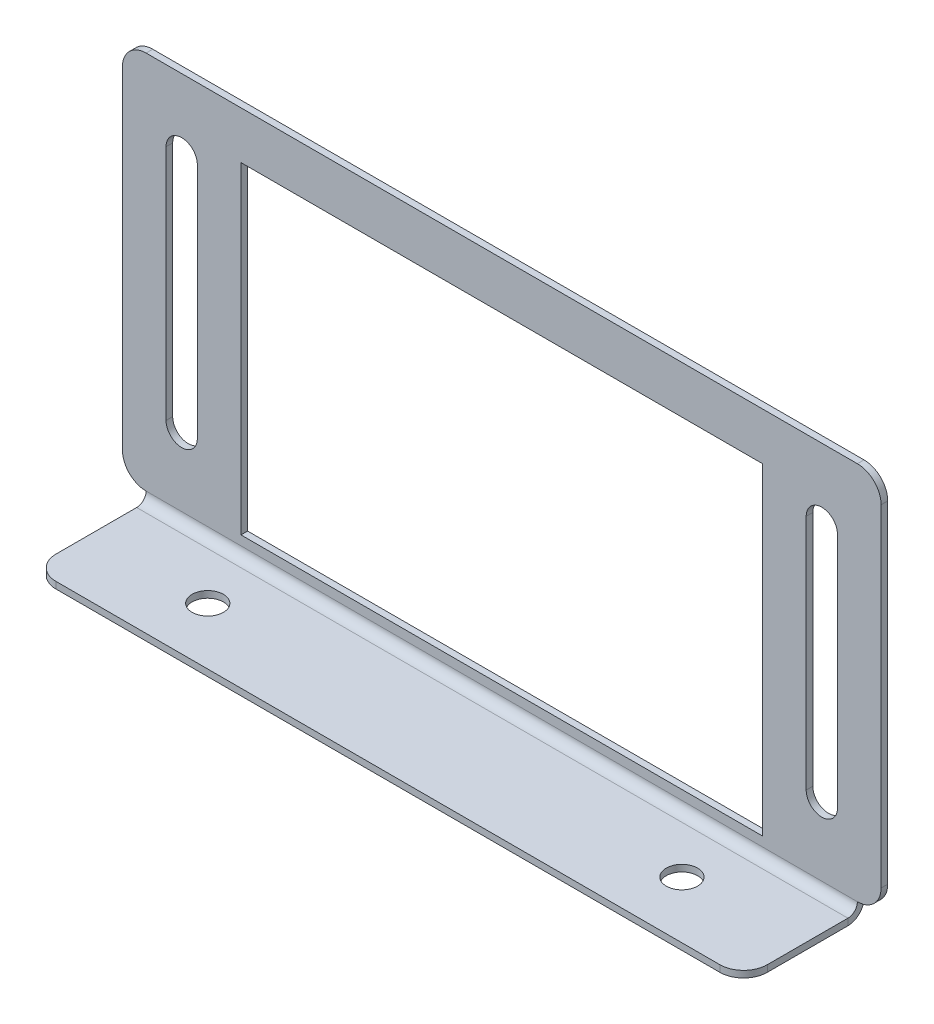
ISO-10303-21;
HEADER;
FILE_DESCRIPTION(('STEP AP214'),'2;1');
FILE_NAME('part.step','',(''),(''),'','','');
FILE_SCHEMA(('AUTOMOTIVE_DESIGN { 1 0 10303 214 1 1 1 1 }'));
ENDSEC;
DATA;
#1=APPLICATION_CONTEXT('core data for automotive mechanical design processes');
#2=APPLICATION_PROTOCOL_DEFINITION('international standard','automotive_design',2000,#1);
#3=PRODUCT_CONTEXT('',#1,'mechanical');
#4=PRODUCT('Part','Part','',(#3));
#5=PRODUCT_RELATED_PRODUCT_CATEGORY('part','',(#4));
#6=PRODUCT_DEFINITION_FORMATION('','',#4);
#7=PRODUCT_DEFINITION_CONTEXT('part definition',#1,'design');
#8=PRODUCT_DEFINITION('design','',#6,#7);
#9=PRODUCT_DEFINITION_SHAPE('','',#8);
#10=(LENGTH_UNIT() NAMED_UNIT(*) SI_UNIT(.MILLI.,.METRE.));
#11=(NAMED_UNIT(*) PLANE_ANGLE_UNIT() SI_UNIT($,.RADIAN.));
#12=(NAMED_UNIT(*) SI_UNIT($,.STERADIAN.) SOLID_ANGLE_UNIT());
#13=UNCERTAINTY_MEASURE_WITH_UNIT(LENGTH_MEASURE(1.E-05),#10,'distance_accuracy_value','');
#14=(GEOMETRIC_REPRESENTATION_CONTEXT(3) GLOBAL_UNCERTAINTY_ASSIGNED_CONTEXT((#13)) GLOBAL_UNIT_ASSIGNED_CONTEXT((#10,
#11,#12)) REPRESENTATION_CONTEXT('',''));
#15=CARTESIAN_POINT('',(0.,0.,0.));
#16=DIRECTION('',(0.,0.,1.));
#17=DIRECTION('',(1.,0.,0.));
#18=AXIS2_PLACEMENT_3D('',#15,#16,#17);
#19=CARTESIAN_POINT('',(-40.,-20.,-0.7));
#20=DIRECTION('',(0.,-1.,0.));
#21=DIRECTION('',(0.,0.,-1.));
#22=AXIS2_PLACEMENT_3D('',#19,#20,#21);
#23=PLANE('',#22);
#24=DIRECTION('',(1.,0.,0.));
#25=VECTOR('',#24,1.);
#26=CARTESIAN_POINT('',(-40.,-20.,-0.7));
#27=LINE('',#26,#25);
#28=CARTESIAN_POINT('',(37.5,-20.,-0.7));
#29=VERTEX_POINT('',#28);
#30=CARTESIAN_POINT('',(37.501,-20.,-0.7));
#31=VERTEX_POINT('',#30);
#32=EDGE_CURVE('E431',#29,#31,#27,.T.);
#33=ORIENTED_EDGE('',*,*,#32,.T.);
#34=DIRECTION('',(0.,0.,1.));
#35=VECTOR('',#34,1.);
#36=CARTESIAN_POINT('',(37.501,-20.,-0.7));
#37=LINE('',#36,#35);
#38=CARTESIAN_POINT('',(37.501,-20.,0.));
#39=VERTEX_POINT('',#38);
#40=EDGE_CURVE('E412',#31,#39,#37,.T.);
#41=ORIENTED_EDGE('',*,*,#40,.T.);
#42=DIRECTION('',(1.,0.,0.));
#43=VECTOR('',#42,1.);
#44=CARTESIAN_POINT('',(-40.,-20.,0.));
#45=LINE('',#44,#43);
#46=CARTESIAN_POINT('',(37.5,-20.,0.));
#47=VERTEX_POINT('',#46);
#48=EDGE_CURVE('E421',#47,#39,#45,.T.);
#49=ORIENTED_EDGE('',*,*,#48,.F.);
#50=DIRECTION('',(0.,0.,-1.));
#51=VECTOR('',#50,1.);
#52=CARTESIAN_POINT('',(37.5,-20.,0.));
#53=LINE('',#52,#51);
#54=EDGE_CURVE('E396',#47,#29,#53,.T.);
#55=ORIENTED_EDGE('',*,*,#54,.T.);
#56=EDGE_LOOP('',(#33,#41,#49,#55));
#57=FACE_BOUND('',#56,.T.);
#58=ADVANCED_FACE('F56',(#57),#23,.T.);
#59=CARTESIAN_POINT('',(40.,20.,-0.7));
#60=DIRECTION('',(1.,0.,0.));
#61=DIRECTION('',(0.,0.,-1.));
#62=AXIS2_PLACEMENT_3D('',#59,#60,#61);
#63=PLANE('',#62);
#64=DIRECTION('',(0.,1.,0.));
#65=VECTOR('',#64,1.);
#66=CARTESIAN_POINT('',(40.,20.,0.));
#67=LINE('',#66,#65);
#68=CARTESIAN_POINT('',(40.,-17.501,0.));
#69=VERTEX_POINT('',#68);
#70=CARTESIAN_POINT('',(40.,17.501,0.));
#71=VERTEX_POINT('',#70);
#72=EDGE_CURVE('E395',#69,#71,#67,.T.);
#73=ORIENTED_EDGE('',*,*,#72,.F.);
#74=DIRECTION('',(0.,0.,1.));
#75=VECTOR('',#74,1.);
#76=CARTESIAN_POINT('',(40.,-17.501,-0.7));
#77=LINE('',#76,#75);
#78=CARTESIAN_POINT('',(40.,-17.501,-0.7));
#79=VERTEX_POINT('',#78);
#80=EDGE_CURVE('E445',#69,#79,#77,.F.);
#81=ORIENTED_EDGE('',*,*,#80,.T.);
#82=DIRECTION('',(0.,1.,0.));
#83=VECTOR('',#82,1.);
#84=CARTESIAN_POINT('',(40.,20.,-0.7));
#85=LINE('',#84,#83);
#86=CARTESIAN_POINT('',(40.,17.501,-0.7));
#87=VERTEX_POINT('',#86);
#88=EDGE_CURVE('E420',#79,#87,#85,.T.);
#89=ORIENTED_EDGE('',*,*,#88,.T.);
#90=DIRECTION('',(0.,0.,1.));
#91=VECTOR('',#90,1.);
#92=CARTESIAN_POINT('',(40.,17.501,-0.7));
#93=LINE('',#92,#91);
#94=EDGE_CURVE('E550',#87,#71,#93,.T.);
#95=ORIENTED_EDGE('',*,*,#94,.T.);
#96=EDGE_LOOP('',(#73,#81,#89,#95));
#97=FACE_BOUND('',#96,.T.);
#98=ADVANCED_FACE('F547',(#97),#63,.T.);
#99=CARTESIAN_POINT('',(-37.501,-20.,0.));
#100=VERTEX_POINT('',#99);
#101=CARTESIAN_POINT('',(-37.5,-20.,0.));
#102=VERTEX_POINT('',#101);
#103=EDGE_CURVE('E417',#100,#102,#45,.T.);
#104=ORIENTED_EDGE('',*,*,#103,.F.);
#105=DIRECTION('',(0.,0.,1.));
#106=VECTOR('',#105,1.);
#107=CARTESIAN_POINT('',(-37.501,-20.,-0.7));
#108=LINE('',#107,#106);
#109=CARTESIAN_POINT('',(-37.501,-20.,-0.7));
#110=VERTEX_POINT('',#109);
#111=EDGE_CURVE('E460',#100,#110,#108,.F.);
#112=ORIENTED_EDGE('',*,*,#111,.T.);
#113=CARTESIAN_POINT('',(-37.5,-20.,-0.699999999999998));
#114=VERTEX_POINT('',#113);
#115=EDGE_CURVE('E416',#110,#114,#27,.T.);
#116=ORIENTED_EDGE('',*,*,#115,.T.);
#117=DIRECTION('',(0.,0.,-1.));
#118=VECTOR('',#117,1.);
#119=CARTESIAN_POINT('',(-37.5,-20.,0.));
#120=LINE('',#119,#118);
#121=EDGE_CURVE('E391',#102,#114,#120,.T.);
#122=ORIENTED_EDGE('',*,*,#121,.F.);
#123=EDGE_LOOP('',(#104,#112,#116,#122));
#124=FACE_BOUND('',#123,.T.);
#125=ADVANCED_FACE('F517',(#124),#23,.T.);
#126=CARTESIAN_POINT('',(-40.,20.,-0.7));
#127=DIRECTION('',(-1.,0.,0.));
#128=DIRECTION('',(0.,-1.,0.));
#129=AXIS2_PLACEMENT_3D('',#126,#127,#128);
#130=PLANE('',#129);
#131=DIRECTION('',(0.,-1.,0.));
#132=VECTOR('',#131,1.);
#133=CARTESIAN_POINT('',(-40.,20.,-0.7));
#134=LINE('',#133,#132);
#135=CARTESIAN_POINT('',(-40.,17.501,-0.7));
#136=VERTEX_POINT('',#135);
#137=CARTESIAN_POINT('',(-40.,-17.501,-0.7));
#138=VERTEX_POINT('',#137);
#139=EDGE_CURVE('E435',#136,#138,#134,.T.);
#140=ORIENTED_EDGE('',*,*,#139,.T.);
#141=DIRECTION('',(0.,0.,1.));
#142=VECTOR('',#141,1.);
#143=CARTESIAN_POINT('',(-40.,-17.501,-0.7));
#144=LINE('',#143,#142);
#145=CARTESIAN_POINT('',(-40.,-17.501,0.));
#146=VERTEX_POINT('',#145);
#147=EDGE_CURVE('E457',#138,#146,#144,.T.);
#148=ORIENTED_EDGE('',*,*,#147,.T.);
#149=DIRECTION('',(0.,-1.,0.));
#150=VECTOR('',#149,1.);
#151=CARTESIAN_POINT('',(-40.,20.,0.));
#152=LINE('',#151,#150);
#153=CARTESIAN_POINT('',(-40.,17.501,0.));
#154=VERTEX_POINT('',#153);
#155=EDGE_CURVE('E426',#154,#146,#152,.T.);
#156=ORIENTED_EDGE('',*,*,#155,.F.);
#157=DIRECTION('',(0.,0.,1.));
#158=VECTOR('',#157,1.);
#159=CARTESIAN_POINT('',(-40.,17.501,-0.7));
#160=LINE('',#159,#158);
#161=EDGE_CURVE('E455',#154,#136,#160,.F.);
#162=ORIENTED_EDGE('',*,*,#161,.T.);
#163=EDGE_LOOP('',(#140,#148,#156,#162));
#164=FACE_BOUND('',#163,.T.);
#165=ADVANCED_FACE('F533',(#164),#130,.T.);
#166=CARTESIAN_POINT('',(-40.,20.,-0.7));
#167=DIRECTION('',(0.,1.,0.));
#168=DIRECTION('',(0.,0.,1.));
#169=AXIS2_PLACEMENT_3D('',#166,#167,#168);
#170=PLANE('',#169);
#171=DIRECTION('',(-1.,0.,0.));
#172=VECTOR('',#171,1.);
#173=CARTESIAN_POINT('',(-40.,20.,-0.7));
#174=LINE('',#173,#172);
#175=CARTESIAN_POINT('',(37.501,20.,-0.7));
#176=VERTEX_POINT('',#175);
#177=CARTESIAN_POINT('',(-37.501,20.,-0.7));
#178=VERTEX_POINT('',#177);
#179=EDGE_CURVE('E1000',#176,#178,#174,.T.);
#180=ORIENTED_EDGE('',*,*,#179,.T.);
#181=DIRECTION('',(0.,0.,1.));
#182=VECTOR('',#181,1.);
#183=CARTESIAN_POINT('',(-37.501,20.,-0.7));
#184=LINE('',#183,#182);
#185=CARTESIAN_POINT('',(-37.501,20.,0.));
#186=VERTEX_POINT('',#185);
#187=EDGE_CURVE('E464',#178,#186,#184,.T.);
#188=ORIENTED_EDGE('',*,*,#187,.T.);
#189=DIRECTION('',(-1.,0.,0.));
#190=VECTOR('',#189,1.);
#191=CARTESIAN_POINT('',(-40.,20.,0.));
#192=LINE('',#191,#190);
#193=CARTESIAN_POINT('',(37.501,20.,0.));
#194=VERTEX_POINT('',#193);
#195=EDGE_CURVE('E539',#194,#186,#192,.T.);
#196=ORIENTED_EDGE('',*,*,#195,.F.);
#197=DIRECTION('',(0.,0.,1.));
#198=VECTOR('',#197,1.);
#199=CARTESIAN_POINT('',(37.501,20.,-0.7));
#200=LINE('',#199,#198);
#201=EDGE_CURVE('E462',#194,#176,#200,.F.);
#202=ORIENTED_EDGE('',*,*,#201,.T.);
#203=EDGE_LOOP('',(#180,#188,#196,#202));
#204=FACE_BOUND('',#203,.T.);
#205=ADVANCED_FACE('F592',(#204),#170,.T.);
#206=CARTESIAN_POINT('',(0.,0.,-0.7));
#207=DIRECTION('',(0.,0.,1.));
#208=DIRECTION('',(1.,0.,0.));
#209=AXIS2_PLACEMENT_3D('',#206,#207,#208);
#210=PLANE('',#209);
#211=DIRECTION('',(0.,1.,0.));
#212=VECTOR('',#211,1.);
#213=CARTESIAN_POINT('',(-27.5,-15.,-0.7));
#214=LINE('',#213,#212);
#215=CARTESIAN_POINT('',(-27.5,-19.,-0.7));
#216=VERTEX_POINT('',#215);
#217=CARTESIAN_POINT('',(-27.5,15.,-0.7));
#218=VERTEX_POINT('',#217);
#219=EDGE_CURVE('E268',#216,#218,#214,.T.);
#220=ORIENTED_EDGE('',*,*,#219,.F.);
#221=DIRECTION('',(-1.,0.,0.));
#222=VECTOR('',#221,1.);
#223=CARTESIAN_POINT('',(-27.5,-19.,-0.7));
#224=LINE('',#223,#222);
#225=CARTESIAN_POINT('',(27.5,-19.,-0.7));
#226=VERTEX_POINT('',#225);
#227=EDGE_CURVE('E247',#226,#216,#224,.T.);
#228=ORIENTED_EDGE('',*,*,#227,.F.);
#229=DIRECTION('',(0.,-1.,0.));
#230=VECTOR('',#229,1.);
#231=CARTESIAN_POINT('',(27.5,15.,-0.7));
#232=LINE('',#231,#230);
#233=CARTESIAN_POINT('',(27.5,15.,-0.7));
#234=VERTEX_POINT('',#233);
#235=EDGE_CURVE('E254',#234,#226,#232,.T.);
#236=ORIENTED_EDGE('',*,*,#235,.F.);
#237=DIRECTION('',(1.,0.,0.));
#238=VECTOR('',#237,1.);
#239=CARTESIAN_POINT('',(-27.5,15.,-0.7));
#240=LINE('',#239,#238);
#241=EDGE_CURVE('E273',#218,#234,#240,.T.);
#242=ORIENTED_EDGE('',*,*,#241,.F.);
#243=EDGE_LOOP('',(#220,#228,#236,#242));
#244=FACE_BOUND('',#243,.T.);
#245=DIRECTION('',(0.,1.,0.));
#246=VECTOR('',#245,1.);
#247=CARTESIAN_POINT('',(-32.1,12.5,-0.7));
#248=LINE('',#247,#246);
#249=CARTESIAN_POINT('',(-32.1,-12.5,-0.7));
#250=VERTEX_POINT('',#249);
#251=CARTESIAN_POINT('',(-32.1,12.5,-0.7));
#252=VERTEX_POINT('',#251);
#253=EDGE_CURVE('E297',#250,#252,#248,.T.);
#254=ORIENTED_EDGE('',*,*,#253,.T.);
#255=CARTESIAN_POINT('',(-33.75,12.5,-0.7));
#256=DIRECTION('',(0.,0.,1.));
#257=DIRECTION('',(-1.,0.,0.));
#258=AXIS2_PLACEMENT_3D('',#255,#256,#257);
#259=CIRCLE('',#258,1.64999999999999);
#260=CARTESIAN_POINT('',(-35.4,12.5,-0.7));
#261=VERTEX_POINT('',#260);
#262=EDGE_CURVE('E287',#252,#261,#259,.T.);
#263=ORIENTED_EDGE('',*,*,#262,.T.);
#264=DIRECTION('',(0.,-1.,0.));
#265=VECTOR('',#264,1.);
#266=CARTESIAN_POINT('',(-35.4,12.5,-0.7));
#267=LINE('',#266,#265);
#268=CARTESIAN_POINT('',(-35.4,-12.5,-0.7));
#269=VERTEX_POINT('',#268);
#270=EDGE_CURVE('E290',#261,#269,#267,.T.);
#271=ORIENTED_EDGE('',*,*,#270,.T.);
#272=CARTESIAN_POINT('',(-33.75,-12.5,-0.7));
#273=DIRECTION('',(0.,0.,1.));
#274=DIRECTION('',(-1.,0.,0.));
#275=AXIS2_PLACEMENT_3D('',#272,#273,#274);
#276=CIRCLE('',#275,1.64999999999999);
#277=EDGE_CURVE('E294',#269,#250,#276,.T.);
#278=ORIENTED_EDGE('',*,*,#277,.T.);
#279=EDGE_LOOP('',(#254,#263,#271,#278));
#280=FACE_BOUND('',#279,.T.);
#281=DIRECTION('',(0.,1.,0.));
#282=VECTOR('',#281,1.);
#283=CARTESIAN_POINT('',(35.4,12.5,-0.7));
#284=LINE('',#283,#282);
#285=CARTESIAN_POINT('',(35.4,-12.5,-0.7));
#286=VERTEX_POINT('',#285);
#287=CARTESIAN_POINT('',(35.4,12.5,-0.7));
#288=VERTEX_POINT('',#287);
#289=EDGE_CURVE('E329',#286,#288,#284,.T.);
#290=ORIENTED_EDGE('',*,*,#289,.T.);
#291=CARTESIAN_POINT('',(33.75,12.5,-0.7));
#292=DIRECTION('',(0.,0.,1.));
#293=DIRECTION('',(1.,0.,0.));
#294=AXIS2_PLACEMENT_3D('',#291,#292,#293);
#295=CIRCLE('',#294,1.64999999999998);
#296=CARTESIAN_POINT('',(32.1,12.5,-0.7));
#297=VERTEX_POINT('',#296);
#298=EDGE_CURVE('E319',#288,#297,#295,.T.);
#299=ORIENTED_EDGE('',*,*,#298,.T.);
#300=DIRECTION('',(0.,-1.,0.));
#301=VECTOR('',#300,1.);
#302=CARTESIAN_POINT('',(32.1,12.5,-0.7));
#303=LINE('',#302,#301);
#304=CARTESIAN_POINT('',(32.1,-12.5,-0.7));
#305=VERTEX_POINT('',#304);
#306=EDGE_CURVE('E322',#297,#305,#303,.T.);
#307=ORIENTED_EDGE('',*,*,#306,.T.);
#308=CARTESIAN_POINT('',(33.75,-12.5,-0.7));
#309=DIRECTION('',(0.,0.,1.));
#310=DIRECTION('',(1.,0.,0.));
#311=AXIS2_PLACEMENT_3D('',#308,#309,#310);
#312=CIRCLE('',#311,1.64999999999998);
#313=EDGE_CURVE('E326',#305,#286,#312,.T.);
#314=ORIENTED_EDGE('',*,*,#313,.T.);
#315=EDGE_LOOP('',(#290,#299,#307,#314));
#316=FACE_BOUND('',#315,.T.);
#317=ORIENTED_EDGE('',*,*,#88,.F.);
#318=CARTESIAN_POINT('',(37.501,-17.501,-0.7));
#319=DIRECTION('',(0.,0.,1.));
#320=DIRECTION('',(1.,0.,0.));
#321=AXIS2_PLACEMENT_3D('',#318,#319,#320);
#322=CIRCLE('',#321,2.499);
#323=EDGE_CURVE('E453',#79,#31,#322,.F.);
#324=ORIENTED_EDGE('',*,*,#323,.T.);
#325=ORIENTED_EDGE('',*,*,#32,.F.);
#326=DIRECTION('',(1.,0.,0.));
#327=VECTOR('',#326,1.);
#328=CARTESIAN_POINT('',(37.5,-20.,-0.699999999999982));
#329=LINE('',#328,#327);
#330=EDGE_CURVE('E409',#29,#114,#329,.F.);
#331=ORIENTED_EDGE('',*,*,#330,.T.);
#332=ORIENTED_EDGE('',*,*,#115,.F.);
#333=CARTESIAN_POINT('',(-37.501,-17.501,-0.7));
#334=DIRECTION('',(0.,0.,1.));
#335=DIRECTION('',(1.,0.,0.));
#336=AXIS2_PLACEMENT_3D('',#333,#334,#335);
#337=CIRCLE('',#336,2.499);
#338=EDGE_CURVE('E451',#110,#138,#337,.F.);
#339=ORIENTED_EDGE('',*,*,#338,.T.);
#340=ORIENTED_EDGE('',*,*,#139,.F.);
#341=CARTESIAN_POINT('',(-37.501,17.501,-0.7));
#342=DIRECTION('',(0.,0.,1.));
#343=DIRECTION('',(1.,0.,0.));
#344=AXIS2_PLACEMENT_3D('',#341,#342,#343);
#345=CIRCLE('',#344,2.499);
#346=EDGE_CURVE('E449',#136,#178,#345,.F.);
#347=ORIENTED_EDGE('',*,*,#346,.T.);
#348=ORIENTED_EDGE('',*,*,#179,.F.);
#349=CARTESIAN_POINT('',(37.501,17.501,-0.7));
#350=DIRECTION('',(0.,0.,1.));
#351=DIRECTION('',(1.,0.,0.));
#352=AXIS2_PLACEMENT_3D('',#349,#350,#351);
#353=CIRCLE('',#352,2.499);
#354=EDGE_CURVE('E447',#176,#87,#353,.F.);
#355=ORIENTED_EDGE('',*,*,#354,.T.);
#356=EDGE_LOOP('',(#317,#324,#325,#331,#332,#339,#340,#347,#348,#355));
#357=FACE_BOUND('',#356,.T.);
#358=ADVANCED_FACE('F265',(#244,#280,#316,#357),#210,.F.);
#359=CARTESIAN_POINT('',(0.,0.,0.));
#360=DIRECTION('',(0.,0.,1.));
#361=DIRECTION('',(1.,0.,0.));
#362=AXIS2_PLACEMENT_3D('',#359,#360,#361);
#363=PLANE('',#362);
#364=DIRECTION('',(1.,0.,0.));
#365=VECTOR('',#364,1.);
#366=CARTESIAN_POINT('',(-27.5,-19.,0.));
#367=LINE('',#366,#365);
#368=CARTESIAN_POINT('',(-27.5,-19.,0.));
#369=VERTEX_POINT('',#368);
#370=CARTESIAN_POINT('',(27.5,-19.,0.));
#371=VERTEX_POINT('',#370);
#372=EDGE_CURVE('E250',#369,#371,#367,.T.);
#373=ORIENTED_EDGE('',*,*,#372,.F.);
#374=DIRECTION('',(0.,-1.,0.));
#375=VECTOR('',#374,1.);
#376=CARTESIAN_POINT('',(-27.5,-15.,0.));
#377=LINE('',#376,#375);
#378=CARTESIAN_POINT('',(-27.5,15.,0.));
#379=VERTEX_POINT('',#378);
#380=EDGE_CURVE('E279',#379,#369,#377,.T.);
#381=ORIENTED_EDGE('',*,*,#380,.F.);
#382=DIRECTION('',(-1.,0.,0.));
#383=VECTOR('',#382,1.);
#384=CARTESIAN_POINT('',(-27.5,15.,0.));
#385=LINE('',#384,#383);
#386=CARTESIAN_POINT('',(27.5,15.,0.));
#387=VERTEX_POINT('',#386);
#388=EDGE_CURVE('E271',#387,#379,#385,.T.);
#389=ORIENTED_EDGE('',*,*,#388,.F.);
#390=DIRECTION('',(0.,1.,0.));
#391=VECTOR('',#390,1.);
#392=CARTESIAN_POINT('',(27.5,15.,0.));
#393=LINE('',#392,#391);
#394=EDGE_CURVE('E269',#371,#387,#393,.T.);
#395=ORIENTED_EDGE('',*,*,#394,.F.);
#396=EDGE_LOOP('',(#373,#381,#389,#395));
#397=FACE_BOUND('',#396,.T.);
#398=CARTESIAN_POINT('',(-33.75,12.5,0.));
#399=DIRECTION('',(0.,0.,1.));
#400=DIRECTION('',(-1.,0.,0.));
#401=AXIS2_PLACEMENT_3D('',#398,#399,#400);
#402=CIRCLE('',#401,1.64999999999999);
#403=CARTESIAN_POINT('',(-32.1,12.5,0.));
#404=VERTEX_POINT('',#403);
#405=CARTESIAN_POINT('',(-35.4,12.5,0.));
#406=VERTEX_POINT('',#405);
#407=EDGE_CURVE('E263',#404,#406,#402,.T.);
#408=ORIENTED_EDGE('',*,*,#407,.F.);
#409=DIRECTION('',(0.,1.,0.));
#410=VECTOR('',#409,1.);
#411=CARTESIAN_POINT('',(-32.1,12.5,0.));
#412=LINE('',#411,#410);
#413=CARTESIAN_POINT('',(-32.1,-12.5,0.));
#414=VERTEX_POINT('',#413);
#415=EDGE_CURVE('E291',#414,#404,#412,.T.);
#416=ORIENTED_EDGE('',*,*,#415,.F.);
#417=CARTESIAN_POINT('',(-33.75,-12.5,0.));
#418=DIRECTION('',(0.,0.,1.));
#419=DIRECTION('',(-1.,0.,0.));
#420=AXIS2_PLACEMENT_3D('',#417,#418,#419);
#421=CIRCLE('',#420,1.64999999999999);
#422=CARTESIAN_POINT('',(-35.4,-12.5,0.));
#423=VERTEX_POINT('',#422);
#424=EDGE_CURVE('E305',#423,#414,#421,.T.);
#425=ORIENTED_EDGE('',*,*,#424,.F.);
#426=DIRECTION('',(0.,-1.,0.));
#427=VECTOR('',#426,1.);
#428=CARTESIAN_POINT('',(-35.4,12.5,0.));
#429=LINE('',#428,#427);
#430=EDGE_CURVE('E302',#406,#423,#429,.T.);
#431=ORIENTED_EDGE('',*,*,#430,.F.);
#432=EDGE_LOOP('',(#408,#416,#425,#431));
#433=FACE_BOUND('',#432,.T.);
#434=CARTESIAN_POINT('',(33.75,12.5,0.));
#435=DIRECTION('',(0.,0.,1.));
#436=DIRECTION('',(1.,0.,0.));
#437=AXIS2_PLACEMENT_3D('',#434,#435,#436);
#438=CIRCLE('',#437,1.64999999999998);
#439=CARTESIAN_POINT('',(35.4,12.5,0.));
#440=VERTEX_POINT('',#439);
#441=CARTESIAN_POINT('',(32.1,12.5,0.));
#442=VERTEX_POINT('',#441);
#443=EDGE_CURVE('E312',#440,#442,#438,.T.);
#444=ORIENTED_EDGE('',*,*,#443,.F.);
#445=DIRECTION('',(0.,1.,0.));
#446=VECTOR('',#445,1.);
#447=CARTESIAN_POINT('',(35.4,12.5,0.));
#448=LINE('',#447,#446);
#449=CARTESIAN_POINT('',(35.4,-12.5,0.));
#450=VERTEX_POINT('',#449);
#451=EDGE_CURVE('E323',#450,#440,#448,.T.);
#452=ORIENTED_EDGE('',*,*,#451,.F.);
#453=CARTESIAN_POINT('',(33.75,-12.5,0.));
#454=DIRECTION('',(0.,0.,1.));
#455=DIRECTION('',(1.,0.,0.));
#456=AXIS2_PLACEMENT_3D('',#453,#454,#455);
#457=CIRCLE('',#456,1.64999999999998);
#458=CARTESIAN_POINT('',(32.1,-12.5,0.));
#459=VERTEX_POINT('',#458);
#460=EDGE_CURVE('E337',#459,#450,#457,.T.);
#461=ORIENTED_EDGE('',*,*,#460,.F.);
#462=DIRECTION('',(0.,-1.,0.));
#463=VECTOR('',#462,1.);
#464=CARTESIAN_POINT('',(32.1,12.5,0.));
#465=LINE('',#464,#463);
#466=EDGE_CURVE('E334',#442,#459,#465,.T.);
#467=ORIENTED_EDGE('',*,*,#466,.F.);
#468=EDGE_LOOP('',(#444,#452,#461,#467));
#469=FACE_BOUND('',#468,.T.);
#470=ORIENTED_EDGE('',*,*,#48,.T.);
#471=CARTESIAN_POINT('',(37.501,-17.501,0.));
#472=DIRECTION('',(0.,0.,1.));
#473=DIRECTION('',(1.,0.,0.));
#474=AXIS2_PLACEMENT_3D('',#471,#472,#473);
#475=CIRCLE('',#474,2.499);
#476=EDGE_CURVE('E543',#39,#69,#475,.T.);
#477=ORIENTED_EDGE('',*,*,#476,.T.);
#478=ORIENTED_EDGE('',*,*,#72,.T.);
#479=CARTESIAN_POINT('',(37.501,17.501,0.));
#480=DIRECTION('',(0.,0.,1.));
#481=DIRECTION('',(1.,0.,0.));
#482=AXIS2_PLACEMENT_3D('',#479,#480,#481);
#483=CIRCLE('',#482,2.499);
#484=EDGE_CURVE('E415',#71,#194,#483,.T.);
#485=ORIENTED_EDGE('',*,*,#484,.T.);
#486=ORIENTED_EDGE('',*,*,#195,.T.);
#487=CARTESIAN_POINT('',(-37.501,17.501,0.));
#488=DIRECTION('',(0.,0.,1.));
#489=DIRECTION('',(1.,0.,0.));
#490=AXIS2_PLACEMENT_3D('',#487,#488,#489);
#491=CIRCLE('',#490,2.499);
#492=EDGE_CURVE('E538',#186,#154,#491,.T.);
#493=ORIENTED_EDGE('',*,*,#492,.T.);
#494=ORIENTED_EDGE('',*,*,#155,.T.);
#495=CARTESIAN_POINT('',(-37.501,-17.501,0.));
#496=DIRECTION('',(0.,0.,1.));
#497=DIRECTION('',(1.,0.,0.));
#498=AXIS2_PLACEMENT_3D('',#495,#496,#497);
#499=CIRCLE('',#498,2.499);
#500=EDGE_CURVE('E529',#146,#100,#499,.T.);
#501=ORIENTED_EDGE('',*,*,#500,.T.);
#502=ORIENTED_EDGE('',*,*,#103,.T.);
#503=DIRECTION('',(1.,0.,0.));
#504=VECTOR('',#503,1.);
#505=CARTESIAN_POINT('',(37.5,-20.,0.));
#506=LINE('',#505,#504);
#507=EDGE_CURVE('E403',#47,#102,#506,.F.);
#508=ORIENTED_EDGE('',*,*,#507,.F.);
#509=EDGE_LOOP('',(#470,#477,#478,#485,#486,#493,#494,#501,#502,#508));
#510=FACE_BOUND('',#509,.T.);
#511=ADVANCED_FACE('F536',(#397,#433,#469,#510),#363,.T.);
#512=CARTESIAN_POINT('',(-37.5,-20.,1.));
#513=DIRECTION('',(-1.,0.,0.));
#514=DIRECTION('',(0.,0.,1.));
#515=AXIS2_PLACEMENT_3D('',#512,#513,#514);
#516=PLANE('',#515);
#517=DIRECTION('',(0.,1.,0.));
#518=VECTOR('',#517,1.);
#519=CARTESIAN_POINT('',(-37.5,-21.7,0.999999999999995));
#520=LINE('',#519,#518);
#521=CARTESIAN_POINT('',(-37.5,-21.,1.));
#522=VERTEX_POINT('',#521);
#523=CARTESIAN_POINT('',(-37.5,-21.7,0.999999999999997));
#524=VERTEX_POINT('',#523);
#525=EDGE_CURVE('E362',#522,#524,#520,.F.);
#526=ORIENTED_EDGE('',*,*,#525,.F.);
#527=CARTESIAN_POINT('',(-37.5,-20.,1.));
#528=DIRECTION('',(1.,0.,0.));
#529=DIRECTION('',(0.,0.,-1.));
#530=AXIS2_PLACEMENT_3D('',#527,#528,#529);
#531=CIRCLE('',#530,1.);
#532=EDGE_CURVE('E399',#102,#522,#531,.F.);
#533=ORIENTED_EDGE('',*,*,#532,.F.);
#534=ORIENTED_EDGE('',*,*,#121,.T.);
#535=CARTESIAN_POINT('',(-37.5,-20.,1.));
#536=DIRECTION('',(1.,0.,0.));
#537=DIRECTION('',(0.,0.,-1.));
#538=AXIS2_PLACEMENT_3D('',#535,#536,#537);
#539=CIRCLE('',#538,1.7);
#540=EDGE_CURVE('E406',#114,#524,#539,.F.);
#541=ORIENTED_EDGE('',*,*,#540,.T.);
#542=EDGE_LOOP('',(#526,#533,#534,#541));
#543=FACE_BOUND('',#542,.T.);
#544=ADVANCED_FACE('F512',(#543),#516,.T.);
#545=CARTESIAN_POINT('',(37.5,-20.,1.00000000000002));
#546=DIRECTION('',(-1.,0.,0.));
#547=DIRECTION('',(0.,0.,1.));
#548=AXIS2_PLACEMENT_3D('',#545,#546,#547);
#549=PLANE('',#548);
#550=CARTESIAN_POINT('',(37.5,-20.,1.00000000000002));
#551=DIRECTION('',(1.,0.,0.));
#552=DIRECTION('',(0.,0.,-1.));
#553=AXIS2_PLACEMENT_3D('',#550,#551,#552);
#554=CIRCLE('',#553,1.);
#555=CARTESIAN_POINT('',(37.5,-21.,1.00000000000002));
#556=VERTEX_POINT('',#555);
#557=EDGE_CURVE('E365',#556,#47,#554,.T.);
#558=ORIENTED_EDGE('',*,*,#557,.F.);
#559=DIRECTION('',(0.,1.,0.));
#560=VECTOR('',#559,1.);
#561=CARTESIAN_POINT('',(37.5,-21.,1.00000000000002));
#562=LINE('',#561,#560);
#563=CARTESIAN_POINT('',(37.5,-21.7,1.00000000000002));
#564=VERTEX_POINT('',#563);
#565=EDGE_CURVE('E379',#556,#564,#562,.F.);
#566=ORIENTED_EDGE('',*,*,#565,.T.);
#567=CARTESIAN_POINT('',(37.5,-20.,1.00000000000002));
#568=DIRECTION('',(1.,0.,0.));
#569=DIRECTION('',(0.,0.,-1.));
#570=AXIS2_PLACEMENT_3D('',#567,#568,#569);
#571=CIRCLE('',#570,1.7);
#572=EDGE_CURVE('E402',#564,#29,#571,.T.);
#573=ORIENTED_EDGE('',*,*,#572,.T.);
#574=ORIENTED_EDGE('',*,*,#54,.F.);
#575=EDGE_LOOP('',(#558,#566,#573,#574));
#576=FACE_BOUND('',#575,.T.);
#577=ADVANCED_FACE('F504',(#576),#549,.F.);
#578=CARTESIAN_POINT('',(37.5,-20.,1.00000000000002));
#579=DIRECTION('',(1.,0.,0.));
#580=DIRECTION('',(0.,-1.,0.));
#581=AXIS2_PLACEMENT_3D('',#578,#579,#580);
#582=CYLINDRICAL_SURFACE('',#581,1.7);
#583=ORIENTED_EDGE('',*,*,#330,.F.);
#584=ORIENTED_EDGE('',*,*,#572,.F.);
#585=DIRECTION('',(1.,0.,0.));
#586=VECTOR('',#585,1.);
#587=CARTESIAN_POINT('',(-37.5,-21.7,0.999999999999995));
#588=LINE('',#587,#586);
#589=EDGE_CURVE('E376',#564,#524,#588,.F.);
#590=ORIENTED_EDGE('',*,*,#589,.T.);
#591=ORIENTED_EDGE('',*,*,#540,.F.);
#592=EDGE_LOOP('',(#583,#584,#590,#591));
#593=FACE_BOUND('',#592,.T.);
#594=ADVANCED_FACE('F509',(#593),#582,.T.);
#595=CARTESIAN_POINT('',(37.5,-20.,1.00000000000002));
#596=DIRECTION('',(1.,0.,0.));
#597=DIRECTION('',(0.,-1.,0.));
#598=AXIS2_PLACEMENT_3D('',#595,#596,#597);
#599=CYLINDRICAL_SURFACE('',#598,1.);
#600=ORIENTED_EDGE('',*,*,#507,.T.);
#601=ORIENTED_EDGE('',*,*,#532,.T.);
#602=DIRECTION('',(1.,0.,0.));
#603=VECTOR('',#602,1.);
#604=CARTESIAN_POINT('',(-37.5,-21.,0.999999999999997));
#605=LINE('',#604,#603);
#606=EDGE_CURVE('E382',#522,#556,#605,.T.);
#607=ORIENTED_EDGE('',*,*,#606,.T.);
#608=ORIENTED_EDGE('',*,*,#557,.T.);
#609=EDGE_LOOP('',(#600,#601,#607,#608));
#610=FACE_BOUND('',#609,.T.);
#611=ADVANCED_FACE('F570',(#610),#599,.F.);
#612=CARTESIAN_POINT('',(-37.5,-21.7,0.));
#613=DIRECTION('',(1.,0.,0.));
#614=DIRECTION('',(0.,0.,-1.));
#615=AXIS2_PLACEMENT_3D('',#612,#613,#614);
#616=PLANE('',#615);
#617=DIRECTION('',(0.,0.,-1.));
#618=VECTOR('',#617,1.);
#619=CARTESIAN_POINT('',(-37.5,-21.7,0.));
#620=LINE('',#619,#618);
#621=CARTESIAN_POINT('',(-37.5,-21.7,9.501));
#622=VERTEX_POINT('',#621);
#623=EDGE_CURVE('E368',#622,#524,#620,.T.);
#624=ORIENTED_EDGE('',*,*,#623,.F.);
#625=DIRECTION('',(0.,1.,0.));
#626=VECTOR('',#625,1.);
#627=CARTESIAN_POINT('',(-37.5,-21.7,9.501));
#628=LINE('',#627,#626);
#629=CARTESIAN_POINT('',(-37.5,-21.,9.501));
#630=VERTEX_POINT('',#629);
#631=EDGE_CURVE('E467',#622,#630,#628,.T.);
#632=ORIENTED_EDGE('',*,*,#631,.T.);
#633=DIRECTION('',(0.,0.,1.));
#634=VECTOR('',#633,1.);
#635=CARTESIAN_POINT('',(-37.5,-21.,0.));
#636=LINE('',#635,#634);
#637=EDGE_CURVE('E374',#630,#522,#636,.F.);
#638=ORIENTED_EDGE('',*,*,#637,.T.);
#639=ORIENTED_EDGE('',*,*,#525,.T.);
#640=EDGE_LOOP('',(#624,#632,#638,#639));
#641=FACE_BOUND('',#640,.T.);
#642=ADVANCED_FACE('F487',(#641),#616,.F.);
#643=CARTESIAN_POINT('',(37.5,-21.7,12.));
#644=DIRECTION('',(-1.,0.,0.));
#645=DIRECTION('',(0.,0.,1.));
#646=AXIS2_PLACEMENT_3D('',#643,#644,#645);
#647=PLANE('',#646);
#648=DIRECTION('',(0.,0.,-1.));
#649=VECTOR('',#648,1.);
#650=CARTESIAN_POINT('',(37.5,-21.,12.));
#651=LINE('',#650,#649);
#652=CARTESIAN_POINT('',(37.5,-21.,9.50100000000002));
#653=VERTEX_POINT('',#652);
#654=EDGE_CURVE('E372',#556,#653,#651,.F.);
#655=ORIENTED_EDGE('',*,*,#654,.T.);
#656=DIRECTION('',(0.,1.,0.));
#657=VECTOR('',#656,1.);
#658=CARTESIAN_POINT('',(37.5,-21.7,9.50100000000002));
#659=LINE('',#658,#657);
#660=CARTESIAN_POINT('',(37.5,-21.7,9.50100000000002));
#661=VERTEX_POINT('',#660);
#662=EDGE_CURVE('E13',#653,#661,#659,.F.);
#663=ORIENTED_EDGE('',*,*,#662,.T.);
#664=DIRECTION('',(0.,0.,1.));
#665=VECTOR('',#664,1.);
#666=CARTESIAN_POINT('',(37.5,-21.7,0.));
#667=LINE('',#666,#665);
#668=EDGE_CURVE('E366',#564,#661,#667,.T.);
#669=ORIENTED_EDGE('',*,*,#668,.F.);
#670=ORIENTED_EDGE('',*,*,#565,.F.);
#671=EDGE_LOOP('',(#655,#663,#669,#670));
#672=FACE_BOUND('',#671,.T.);
#673=ADVANCED_FACE('F501',(#672),#647,.F.);
#674=CARTESIAN_POINT('',(0.,-21.7,0.));
#675=DIRECTION('',(0.,1.,0.));
#676=DIRECTION('',(0.,0.,1.));
#677=AXIS2_PLACEMENT_3D('',#674,#675,#676);
#678=PLANE('',#677);
#679=CARTESIAN_POINT('',(-25.,-21.7,5.99999999999995));
#680=DIRECTION('',(0.,1.,0.));
#681=DIRECTION('',(0.,0.,1.));
#682=AXIS2_PLACEMENT_3D('',#679,#680,#681);
#683=CIRCLE('',#682,1.65000000000136);
#684=CARTESIAN_POINT('',(-25.,-21.7,7.65000000000131));
#685=VERTEX_POINT('',#684);
#686=EDGE_CURVE('E353',#685,#685,#683,.F.);
#687=ORIENTED_EDGE('',*,*,#686,.F.);
#688=EDGE_LOOP('',(#687));
#689=FACE_BOUND('',#688,.T.);
#690=CARTESIAN_POINT('',(25.,-21.7,5.99999999999995));
#691=DIRECTION('',(0.,1.,0.));
#692=DIRECTION('',(0.,0.,1.));
#693=AXIS2_PLACEMENT_3D('',#690,#691,#692);
#694=CIRCLE('',#693,1.64999999999864);
#695=CARTESIAN_POINT('',(25.,-21.7,7.64999999999859));
#696=VERTEX_POINT('',#695);
#697=EDGE_CURVE('E359',#696,#696,#694,.F.);
#698=ORIENTED_EDGE('',*,*,#697,.F.);
#699=EDGE_LOOP('',(#698));
#700=FACE_BOUND('',#699,.T.);
#701=DIRECTION('',(-1.,0.,0.));
#702=VECTOR('',#701,1.);
#703=CARTESIAN_POINT('',(0.,-21.7,12.));
#704=LINE('',#703,#702);
#705=CARTESIAN_POINT('',(35.001,-21.7,12.));
#706=VERTEX_POINT('',#705);
#707=CARTESIAN_POINT('',(-35.001,-21.7,12.));
#708=VERTEX_POINT('',#707);
#709=EDGE_CURVE('E363',#706,#708,#704,.T.);
#710=ORIENTED_EDGE('',*,*,#709,.T.);
#711=CARTESIAN_POINT('',(-35.001,-21.7,9.501));
#712=DIRECTION('',(0.,1.,0.));
#713=DIRECTION('',(0.,0.,1.));
#714=AXIS2_PLACEMENT_3D('',#711,#712,#713);
#715=CIRCLE('',#714,2.499);
#716=EDGE_CURVE('E64',#708,#622,#715,.F.);
#717=ORIENTED_EDGE('',*,*,#716,.T.);
#718=ORIENTED_EDGE('',*,*,#623,.T.);
#719=ORIENTED_EDGE('',*,*,#589,.F.);
#720=ORIENTED_EDGE('',*,*,#668,.T.);
#721=CARTESIAN_POINT('',(35.001,-21.7,9.50100000000002));
#722=DIRECTION('',(0.,1.,0.));
#723=DIRECTION('',(0.,0.,1.));
#724=AXIS2_PLACEMENT_3D('',#721,#722,#723);
#725=CIRCLE('',#724,2.499);
#726=EDGE_CURVE('E478',#661,#706,#725,.F.);
#727=ORIENTED_EDGE('',*,*,#726,.T.);
#728=EDGE_LOOP('',(#710,#717,#718,#719,#720,#727));
#729=FACE_BOUND('',#728,.T.);
#730=ADVANCED_FACE('F482',(#689,#700,#729),#678,.F.);
#731=CARTESIAN_POINT('',(0.,-21.,0.));
#732=DIRECTION('',(0.,1.,0.));
#733=DIRECTION('',(0.,0.,1.));
#734=AXIS2_PLACEMENT_3D('',#731,#732,#733);
#735=PLANE('',#734);
#736=CARTESIAN_POINT('',(-25.,-21.,5.99999999999996));
#737=DIRECTION('',(0.,1.,0.));
#738=DIRECTION('',(0.,0.,-1.));
#739=AXIS2_PLACEMENT_3D('',#736,#737,#738);
#740=CIRCLE('',#739,1.65000000000136);
#741=CARTESIAN_POINT('',(-25.,-21.,4.3499999999986));
#742=VERTEX_POINT('',#741);
#743=EDGE_CURVE('E344',#742,#742,#740,.T.);
#744=ORIENTED_EDGE('',*,*,#743,.F.);
#745=EDGE_LOOP('',(#744));
#746=FACE_BOUND('',#745,.T.);
#747=CARTESIAN_POINT('',(25.,-21.,5.99999999999995));
#748=DIRECTION('',(0.,1.,0.));
#749=DIRECTION('',(0.,0.,1.));
#750=AXIS2_PLACEMENT_3D('',#747,#748,#749);
#751=CIRCLE('',#750,1.64999999999864);
#752=CARTESIAN_POINT('',(25.,-21.,7.64999999999859));
#753=VERTEX_POINT('',#752);
#754=EDGE_CURVE('E356',#753,#753,#751,.T.);
#755=ORIENTED_EDGE('',*,*,#754,.F.);
#756=EDGE_LOOP('',(#755));
#757=FACE_BOUND('',#756,.T.);
#758=ORIENTED_EDGE('',*,*,#637,.F.);
#759=CARTESIAN_POINT('',(-35.001,-21.,9.501));
#760=DIRECTION('',(0.,1.,0.));
#761=DIRECTION('',(0.,0.,1.));
#762=AXIS2_PLACEMENT_3D('',#759,#760,#761);
#763=CIRCLE('',#762,2.499);
#764=CARTESIAN_POINT('',(-35.001,-21.,12.));
#765=VERTEX_POINT('',#764);
#766=EDGE_CURVE('E472',#630,#765,#763,.T.);
#767=ORIENTED_EDGE('',*,*,#766,.T.);
#768=DIRECTION('',(1.,0.,0.));
#769=VECTOR('',#768,1.);
#770=CARTESIAN_POINT('',(-37.5,-21.,12.));
#771=LINE('',#770,#769);
#772=CARTESIAN_POINT('',(35.001,-21.,12.));
#773=VERTEX_POINT('',#772);
#774=EDGE_CURVE('E370',#773,#765,#771,.F.);
#775=ORIENTED_EDGE('',*,*,#774,.F.);
#776=CARTESIAN_POINT('',(35.001,-21.,9.50100000000002));
#777=DIRECTION('',(0.,1.,0.));
#778=DIRECTION('',(0.,0.,1.));
#779=AXIS2_PLACEMENT_3D('',#776,#777,#778);
#780=CIRCLE('',#779,2.499);
#781=EDGE_CURVE('E470',#773,#653,#780,.T.);
#782=ORIENTED_EDGE('',*,*,#781,.T.);
#783=ORIENTED_EDGE('',*,*,#654,.F.);
#784=ORIENTED_EDGE('',*,*,#606,.F.);
#785=EDGE_LOOP('',(#758,#767,#775,#782,#783,#784));
#786=FACE_BOUND('',#785,.T.);
#787=ADVANCED_FACE('F493',(#746,#757,#786),#735,.T.);
#788=CARTESIAN_POINT('',(-37.5,-21.7,12.));
#789=DIRECTION('',(0.,0.,-1.));
#790=DIRECTION('',(0.,1.,0.));
#791=AXIS2_PLACEMENT_3D('',#788,#789,#790);
#792=PLANE('',#791);
#793=ORIENTED_EDGE('',*,*,#774,.T.);
#794=DIRECTION('',(0.,1.,0.));
#795=VECTOR('',#794,1.);
#796=CARTESIAN_POINT('',(-35.001,-21.7,12.));
#797=LINE('',#796,#795);
#798=EDGE_CURVE('E77',#765,#708,#797,.F.);
#799=ORIENTED_EDGE('',*,*,#798,.T.);
#800=ORIENTED_EDGE('',*,*,#709,.F.);
#801=DIRECTION('',(0.,1.,0.));
#802=VECTOR('',#801,1.);
#803=CARTESIAN_POINT('',(35.001,-21.7,12.));
#804=LINE('',#803,#802);
#805=EDGE_CURVE('E474',#706,#773,#804,.T.);
#806=ORIENTED_EDGE('',*,*,#805,.T.);
#807=EDGE_LOOP('',(#793,#799,#800,#806));
#808=FACE_BOUND('',#807,.T.);
#809=ADVANCED_FACE('F495',(#808),#792,.F.);
#810=CARTESIAN_POINT('',(25.,-21.701025,5.99999999999995));
#811=DIRECTION('',(0.,1.,0.));
#812=DIRECTION('',(0.,0.,1.));
#813=AXIS2_PLACEMENT_3D('',#810,#811,#812);
#814=CYLINDRICAL_SURFACE('',#813,1.64999999999864);
#815=ORIENTED_EDGE('',*,*,#754,.T.);
#816=EDGE_LOOP('',(#815));
#817=FACE_BOUND('',#816,.T.);
#818=ORIENTED_EDGE('',*,*,#697,.T.);
#819=EDGE_LOOP('',(#818));
#820=FACE_BOUND('',#819,.T.);
#821=ADVANCED_FACE('F661',(#817,#820),#814,.F.);
#822=CARTESIAN_POINT('',(-25.,-21.701025,5.99999999999995));
#823=DIRECTION('',(0.,1.,0.));
#824=DIRECTION('',(0.,0.,1.));
#825=AXIS2_PLACEMENT_3D('',#822,#823,#824);
#826=CYLINDRICAL_SURFACE('',#825,1.65000000000136);
#827=ORIENTED_EDGE('',*,*,#743,.T.);
#828=EDGE_LOOP('',(#827));
#829=FACE_BOUND('',#828,.T.);
#830=ORIENTED_EDGE('',*,*,#686,.T.);
#831=EDGE_LOOP('',(#830));
#832=FACE_BOUND('',#831,.T.);
#833=ADVANCED_FACE('F874',(#829,#832),#826,.F.);
#834=CARTESIAN_POINT('',(33.75,12.5,-0.7));
#835=DIRECTION('',(0.,0.,1.));
#836=DIRECTION('',(1.,0.,0.));
#837=AXIS2_PLACEMENT_3D('',#834,#835,#836);
#838=CYLINDRICAL_SURFACE('',#837,1.64999999999998);
#839=ORIENTED_EDGE('',*,*,#443,.T.);
#840=DIRECTION('',(0.,0.,1.));
#841=VECTOR('',#840,1.);
#842=CARTESIAN_POINT('',(32.1,12.5,-0.7));
#843=LINE('',#842,#841);
#844=EDGE_CURVE('E332',#297,#442,#843,.T.);
#845=ORIENTED_EDGE('',*,*,#844,.F.);
#846=ORIENTED_EDGE('',*,*,#298,.F.);
#847=DIRECTION('',(0.,0.,1.));
#848=VECTOR('',#847,1.);
#849=CARTESIAN_POINT('',(35.4,12.5,-0.7));
#850=LINE('',#849,#848);
#851=EDGE_CURVE('E342',#288,#440,#850,.T.);
#852=ORIENTED_EDGE('',*,*,#851,.T.);
#853=EDGE_LOOP('',(#839,#845,#846,#852));
#854=FACE_BOUND('',#853,.T.);
#855=ADVANCED_FACE('F863',(#854),#838,.F.);
#856=CARTESIAN_POINT('',(35.4,12.5,-0.7));
#857=DIRECTION('',(1.,0.,0.));
#858=DIRECTION('',(0.,0.,-1.));
#859=AXIS2_PLACEMENT_3D('',#856,#857,#858);
#860=PLANE('',#859);
#861=ORIENTED_EDGE('',*,*,#451,.T.);
#862=ORIENTED_EDGE('',*,*,#851,.F.);
#863=ORIENTED_EDGE('',*,*,#289,.F.);
#864=DIRECTION('',(0.,0.,1.));
#865=VECTOR('',#864,1.);
#866=CARTESIAN_POINT('',(35.4,-12.5,-0.7));
#867=LINE('',#866,#865);
#868=EDGE_CURVE('E345',#286,#450,#867,.T.);
#869=ORIENTED_EDGE('',*,*,#868,.T.);
#870=EDGE_LOOP('',(#861,#862,#863,#869));
#871=FACE_BOUND('',#870,.T.);
#872=ADVANCED_FACE('F852',(#871),#860,.F.);
#873=CARTESIAN_POINT('',(33.75,-12.5,-0.7));
#874=DIRECTION('',(0.,0.,1.));
#875=DIRECTION('',(1.,0.,0.));
#876=AXIS2_PLACEMENT_3D('',#873,#874,#875);
#877=CYLINDRICAL_SURFACE('',#876,1.64999999999998);
#878=ORIENTED_EDGE('',*,*,#460,.T.);
#879=ORIENTED_EDGE('',*,*,#868,.F.);
#880=ORIENTED_EDGE('',*,*,#313,.F.);
#881=DIRECTION('',(0.,0.,1.));
#882=VECTOR('',#881,1.);
#883=CARTESIAN_POINT('',(32.1,-12.5,-0.7));
#884=LINE('',#883,#882);
#885=EDGE_CURVE('E347',#305,#459,#884,.T.);
#886=ORIENTED_EDGE('',*,*,#885,.T.);
#887=EDGE_LOOP('',(#878,#879,#880,#886));
#888=FACE_BOUND('',#887,.T.);
#889=ADVANCED_FACE('F841',(#888),#877,.F.);
#890=CARTESIAN_POINT('',(32.1,12.5,-0.7));
#891=DIRECTION('',(-1.,0.,0.));
#892=DIRECTION('',(0.,0.,1.));
#893=AXIS2_PLACEMENT_3D('',#890,#891,#892);
#894=PLANE('',#893);
#895=ORIENTED_EDGE('',*,*,#466,.T.);
#896=ORIENTED_EDGE('',*,*,#885,.F.);
#897=ORIENTED_EDGE('',*,*,#306,.F.);
#898=ORIENTED_EDGE('',*,*,#844,.T.);
#899=EDGE_LOOP('',(#895,#896,#897,#898));
#900=FACE_BOUND('',#899,.T.);
#901=ADVANCED_FACE('F830',(#900),#894,.F.);
#902=CARTESIAN_POINT('',(-33.75,12.5,-0.7));
#903=DIRECTION('',(0.,0.,1.));
#904=DIRECTION('',(1.,0.,0.));
#905=AXIS2_PLACEMENT_3D('',#902,#903,#904);
#906=CYLINDRICAL_SURFACE('',#905,1.64999999999999);
#907=ORIENTED_EDGE('',*,*,#407,.T.);
#908=DIRECTION('',(0.,0.,1.));
#909=VECTOR('',#908,1.);
#910=CARTESIAN_POINT('',(-35.4,12.5,-0.7));
#911=LINE('',#910,#909);
#912=EDGE_CURVE('E300',#261,#406,#911,.T.);
#913=ORIENTED_EDGE('',*,*,#912,.F.);
#914=ORIENTED_EDGE('',*,*,#262,.F.);
#915=DIRECTION('',(0.,0.,1.));
#916=VECTOR('',#915,1.);
#917=CARTESIAN_POINT('',(-32.1,12.5,-0.7));
#918=LINE('',#917,#916);
#919=EDGE_CURVE('E310',#252,#404,#918,.T.);
#920=ORIENTED_EDGE('',*,*,#919,.T.);
#921=EDGE_LOOP('',(#907,#913,#914,#920));
#922=FACE_BOUND('',#921,.T.);
#923=ADVANCED_FACE('F819',(#922),#906,.F.);
#924=CARTESIAN_POINT('',(-32.1,12.5,-0.7));
#925=DIRECTION('',(1.,0.,0.));
#926=DIRECTION('',(0.,0.,-1.));
#927=AXIS2_PLACEMENT_3D('',#924,#925,#926);
#928=PLANE('',#927);
#929=ORIENTED_EDGE('',*,*,#415,.T.);
#930=ORIENTED_EDGE('',*,*,#919,.F.);
#931=ORIENTED_EDGE('',*,*,#253,.F.);
#932=DIRECTION('',(0.,0.,1.));
#933=VECTOR('',#932,1.);
#934=CARTESIAN_POINT('',(-32.1,-12.5,-0.7));
#935=LINE('',#934,#933);
#936=EDGE_CURVE('E313',#250,#414,#935,.T.);
#937=ORIENTED_EDGE('',*,*,#936,.T.);
#938=EDGE_LOOP('',(#929,#930,#931,#937));
#939=FACE_BOUND('',#938,.T.);
#940=ADVANCED_FACE('F808',(#939),#928,.F.);
#941=CARTESIAN_POINT('',(-33.75,-12.5,-0.7));
#942=DIRECTION('',(0.,0.,1.));
#943=DIRECTION('',(1.,0.,0.));
#944=AXIS2_PLACEMENT_3D('',#941,#942,#943);
#945=CYLINDRICAL_SURFACE('',#944,1.64999999999999);
#946=ORIENTED_EDGE('',*,*,#424,.T.);
#947=ORIENTED_EDGE('',*,*,#936,.F.);
#948=ORIENTED_EDGE('',*,*,#277,.F.);
#949=DIRECTION('',(0.,0.,1.));
#950=VECTOR('',#949,1.);
#951=CARTESIAN_POINT('',(-35.4,-12.5,-0.7));
#952=LINE('',#951,#950);
#953=EDGE_CURVE('E315',#269,#423,#952,.T.);
#954=ORIENTED_EDGE('',*,*,#953,.T.);
#955=EDGE_LOOP('',(#946,#947,#948,#954));
#956=FACE_BOUND('',#955,.T.);
#957=ADVANCED_FACE('F797',(#956),#945,.F.);
#958=CARTESIAN_POINT('',(-35.4,12.5,-0.7));
#959=DIRECTION('',(-1.,0.,0.));
#960=DIRECTION('',(0.,0.,1.));
#961=AXIS2_PLACEMENT_3D('',#958,#959,#960);
#962=PLANE('',#961);
#963=ORIENTED_EDGE('',*,*,#430,.T.);
#964=ORIENTED_EDGE('',*,*,#953,.F.);
#965=ORIENTED_EDGE('',*,*,#270,.F.);
#966=ORIENTED_EDGE('',*,*,#912,.T.);
#967=EDGE_LOOP('',(#963,#964,#965,#966));
#968=FACE_BOUND('',#967,.T.);
#969=ADVANCED_FACE('F787',(#968),#962,.F.);
#970=CARTESIAN_POINT('',(-27.5,-19.,-0.70105));
#971=DIRECTION('',(0.,-1.,0.));
#972=DIRECTION('',(0.,0.,-1.));
#973=AXIS2_PLACEMENT_3D('',#970,#971,#972);
#974=PLANE('',#973);
#975=ORIENTED_EDGE('',*,*,#227,.T.);
#976=DIRECTION('',(0.,0.,1.));
#977=VECTOR('',#976,1.);
#978=CARTESIAN_POINT('',(-27.5,-19.,-0.70105));
#979=LINE('',#978,#977);
#980=EDGE_CURVE('E255',#216,#369,#979,.T.);
#981=ORIENTED_EDGE('',*,*,#980,.T.);
#982=ORIENTED_EDGE('',*,*,#372,.T.);
#983=DIRECTION('',(0.,0.,1.));
#984=VECTOR('',#983,1.);
#985=CARTESIAN_POINT('',(27.5,-19.,-0.70105));
#986=LINE('',#985,#984);
#987=EDGE_CURVE('E243',#226,#371,#986,.T.);
#988=ORIENTED_EDGE('',*,*,#987,.F.);
#989=EDGE_LOOP('',(#975,#981,#982,#988));
#990=FACE_BOUND('',#989,.T.);
#991=ADVANCED_FACE('F245',(#990),#974,.F.);
#992=CARTESIAN_POINT('',(-27.5,-15.,-0.70105));
#993=DIRECTION('',(-1.,0.,0.));
#994=DIRECTION('',(0.,0.,1.));
#995=AXIS2_PLACEMENT_3D('',#992,#993,#994);
#996=PLANE('',#995);
#997=ORIENTED_EDGE('',*,*,#219,.T.);
#998=DIRECTION('',(0.,0.,1.));
#999=VECTOR('',#998,1.);
#1000=CARTESIAN_POINT('',(-27.5,15.,-0.70105));
#1001=LINE('',#1000,#999);
#1002=EDGE_CURVE('E284',#218,#379,#1001,.T.);
#1003=ORIENTED_EDGE('',*,*,#1002,.T.);
#1004=ORIENTED_EDGE('',*,*,#380,.T.);
#1005=ORIENTED_EDGE('',*,*,#980,.F.);
#1006=EDGE_LOOP('',(#997,#1003,#1004,#1005));
#1007=FACE_BOUND('',#1006,.T.);
#1008=ADVANCED_FACE('F766',(#1007),#996,.F.);
#1009=CARTESIAN_POINT('',(-27.5,15.,-0.70105));
#1010=DIRECTION('',(0.,1.,0.));
#1011=DIRECTION('',(0.,0.,1.));
#1012=AXIS2_PLACEMENT_3D('',#1009,#1010,#1011);
#1013=PLANE('',#1012);
#1014=ORIENTED_EDGE('',*,*,#241,.T.);
#1015=DIRECTION('',(0.,0.,1.));
#1016=VECTOR('',#1015,1.);
#1017=CARTESIAN_POINT('',(27.5,15.,-0.70105));
#1018=LINE('',#1017,#1016);
#1019=EDGE_CURVE('E260',#234,#387,#1018,.T.);
#1020=ORIENTED_EDGE('',*,*,#1019,.T.);
#1021=ORIENTED_EDGE('',*,*,#388,.T.);
#1022=ORIENTED_EDGE('',*,*,#1002,.F.);
#1023=EDGE_LOOP('',(#1014,#1020,#1021,#1022));
#1024=FACE_BOUND('',#1023,.T.);
#1025=ADVANCED_FACE('F756',(#1024),#1013,.F.);
#1026=CARTESIAN_POINT('',(27.5,15.,-0.70105));
#1027=DIRECTION('',(1.,0.,0.));
#1028=DIRECTION('',(0.,1.,0.));
#1029=AXIS2_PLACEMENT_3D('',#1026,#1027,#1028);
#1030=PLANE('',#1029);
#1031=ORIENTED_EDGE('',*,*,#235,.T.);
#1032=ORIENTED_EDGE('',*,*,#987,.T.);
#1033=ORIENTED_EDGE('',*,*,#394,.T.);
#1034=ORIENTED_EDGE('',*,*,#1019,.F.);
#1035=EDGE_LOOP('',(#1031,#1032,#1033,#1034));
#1036=FACE_BOUND('',#1035,.T.);
#1037=ADVANCED_FACE('F259',(#1036),#1030,.F.);
#1038=CARTESIAN_POINT('',(37.501,-17.501,-0.7));
#1039=DIRECTION('',(0.,0.,1.));
#1040=DIRECTION('',(1.,0.,0.));
#1041=AXIS2_PLACEMENT_3D('',#1038,#1039,#1040);
#1042=CYLINDRICAL_SURFACE('',#1041,2.499);
#1043=ORIENTED_EDGE('',*,*,#323,.F.);
#1044=ORIENTED_EDGE('',*,*,#80,.F.);
#1045=ORIENTED_EDGE('',*,*,#476,.F.);
#1046=ORIENTED_EDGE('',*,*,#40,.F.);
#1047=EDGE_LOOP('',(#1043,#1044,#1045,#1046));
#1048=FACE_BOUND('',#1047,.T.);
#1049=ADVANCED_FACE('F553',(#1048),#1042,.T.);
#1050=CARTESIAN_POINT('',(-37.501,-17.501,-0.7));
#1051=DIRECTION('',(0.,0.,1.));
#1052=DIRECTION('',(1.,0.,0.));
#1053=AXIS2_PLACEMENT_3D('',#1050,#1051,#1052);
#1054=CYLINDRICAL_SURFACE('',#1053,2.499);
#1055=ORIENTED_EDGE('',*,*,#338,.F.);
#1056=ORIENTED_EDGE('',*,*,#111,.F.);
#1057=ORIENTED_EDGE('',*,*,#500,.F.);
#1058=ORIENTED_EDGE('',*,*,#147,.F.);
#1059=EDGE_LOOP('',(#1055,#1056,#1057,#1058));
#1060=FACE_BOUND('',#1059,.T.);
#1061=ADVANCED_FACE('F528',(#1060),#1054,.T.);
#1062=CARTESIAN_POINT('',(-37.501,17.501,-0.7));
#1063=DIRECTION('',(0.,0.,1.));
#1064=DIRECTION('',(1.,0.,0.));
#1065=AXIS2_PLACEMENT_3D('',#1062,#1063,#1064);
#1066=CYLINDRICAL_SURFACE('',#1065,2.499);
#1067=ORIENTED_EDGE('',*,*,#346,.F.);
#1068=ORIENTED_EDGE('',*,*,#161,.F.);
#1069=ORIENTED_EDGE('',*,*,#492,.F.);
#1070=ORIENTED_EDGE('',*,*,#187,.F.);
#1071=EDGE_LOOP('',(#1067,#1068,#1069,#1070));
#1072=FACE_BOUND('',#1071,.T.);
#1073=ADVANCED_FACE('F603',(#1072),#1066,.T.);
#1074=CARTESIAN_POINT('',(37.501,17.501,-0.7));
#1075=DIRECTION('',(0.,0.,1.));
#1076=DIRECTION('',(1.,0.,0.));
#1077=AXIS2_PLACEMENT_3D('',#1074,#1075,#1076);
#1078=CYLINDRICAL_SURFACE('',#1077,2.499);
#1079=ORIENTED_EDGE('',*,*,#354,.F.);
#1080=ORIENTED_EDGE('',*,*,#201,.F.);
#1081=ORIENTED_EDGE('',*,*,#484,.F.);
#1082=ORIENTED_EDGE('',*,*,#94,.F.);
#1083=EDGE_LOOP('',(#1079,#1080,#1081,#1082));
#1084=FACE_BOUND('',#1083,.T.);
#1085=ADVANCED_FACE('F606',(#1084),#1078,.T.);
#1086=CARTESIAN_POINT('',(-35.001,-21.7,9.501));
#1087=DIRECTION('',(0.,1.,0.));
#1088=DIRECTION('',(0.,0.,1.));
#1089=AXIS2_PLACEMENT_3D('',#1086,#1087,#1088);
#1090=CYLINDRICAL_SURFACE('',#1089,2.499);
#1091=ORIENTED_EDGE('',*,*,#716,.F.);
#1092=ORIENTED_EDGE('',*,*,#798,.F.);
#1093=ORIENTED_EDGE('',*,*,#766,.F.);
#1094=ORIENTED_EDGE('',*,*,#631,.F.);
#1095=EDGE_LOOP('',(#1091,#1092,#1093,#1094));
#1096=FACE_BOUND('',#1095,.T.);
#1097=ADVANCED_FACE('F490',(#1096),#1090,.T.);
#1098=CARTESIAN_POINT('',(35.001,-21.7,9.50100000000002));
#1099=DIRECTION('',(0.,1.,0.));
#1100=DIRECTION('',(0.,0.,1.));
#1101=AXIS2_PLACEMENT_3D('',#1098,#1099,#1100);
#1102=CYLINDRICAL_SURFACE('',#1101,2.499);
#1103=ORIENTED_EDGE('',*,*,#726,.F.);
#1104=ORIENTED_EDGE('',*,*,#662,.F.);
#1105=ORIENTED_EDGE('',*,*,#781,.F.);
#1106=ORIENTED_EDGE('',*,*,#805,.F.);
#1107=EDGE_LOOP('',(#1103,#1104,#1105,#1106));
#1108=FACE_BOUND('',#1107,.T.);
#1109=ADVANCED_FACE('F58',(#1108),#1102,.T.);
#1110=CLOSED_SHELL('',(#58,#98,#125,#165,#205,#358,#511,#544,#577,#594,#611,#642,#673,#730,#787,
#809,#821,#833,#855,#872,#889,#901,#923,#940,#957,#969,#991,#1008,#1025,#1037,#1049,#1061,#1073,
#1085,#1097,#1109));
#1111=MANIFOLD_SOLID_BREP('B2',#1110);
#1112=ADVANCED_BREP_SHAPE_REPRESENTATION('',(#18,#1111),#14);
#1113=SHAPE_DEFINITION_REPRESENTATION(#9,#1112);
ENDSEC;
END-ISO-10303-21;
